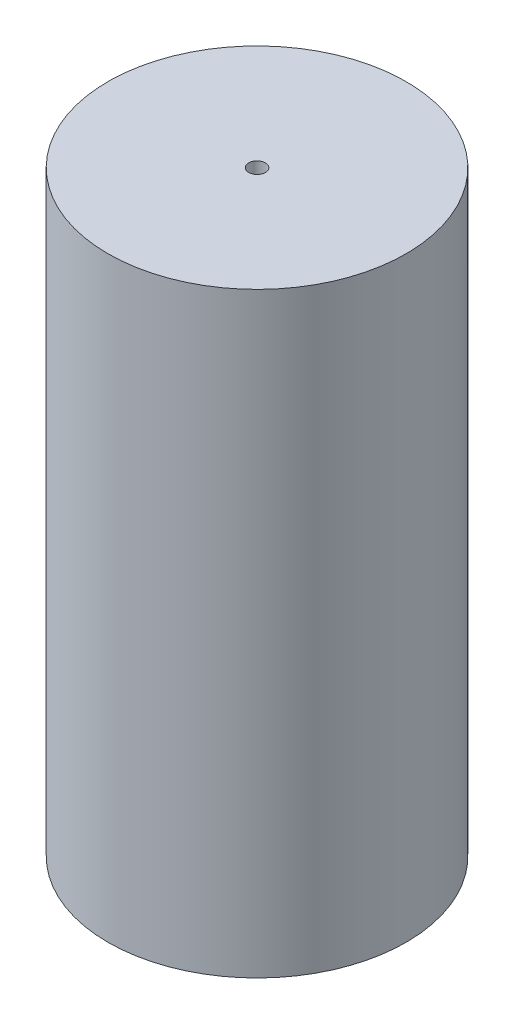
ISO-10303-21;
HEADER;
FILE_DESCRIPTION(('STEP AP214'),'2;1');
FILE_NAME('part.step','',(''),(''),'','','');
FILE_SCHEMA(('AUTOMOTIVE_DESIGN { 1 0 10303 214 1 1 1 1 }'));
ENDSEC;
DATA;
#1=APPLICATION_CONTEXT('core data for automotive mechanical design processes');
#2=APPLICATION_PROTOCOL_DEFINITION('international standard','automotive_design',2000,#1);
#3=PRODUCT_CONTEXT('',#1,'mechanical');
#4=PRODUCT('Part','Part','',(#3));
#5=PRODUCT_RELATED_PRODUCT_CATEGORY('part','',(#4));
#6=PRODUCT_DEFINITION_FORMATION('','',#4);
#7=PRODUCT_DEFINITION_CONTEXT('part definition',#1,'design');
#8=PRODUCT_DEFINITION('design','',#6,#7);
#9=PRODUCT_DEFINITION_SHAPE('','',#8);
#10=(LENGTH_UNIT() NAMED_UNIT(*) SI_UNIT(.MILLI.,.METRE.));
#11=(NAMED_UNIT(*) PLANE_ANGLE_UNIT() SI_UNIT($,.RADIAN.));
#12=(NAMED_UNIT(*) SI_UNIT($,.STERADIAN.) SOLID_ANGLE_UNIT());
#13=UNCERTAINTY_MEASURE_WITH_UNIT(LENGTH_MEASURE(1.E-05),#10,'distance_accuracy_value','');
#14=(GEOMETRIC_REPRESENTATION_CONTEXT(3) GLOBAL_UNCERTAINTY_ASSIGNED_CONTEXT((#13)) GLOBAL_UNIT_ASSIGNED_CONTEXT((#10,
#11,#12)) REPRESENTATION_CONTEXT('',''));
#15=CARTESIAN_POINT('',(0.,0.,0.));
#16=DIRECTION('',(0.,0.,1.));
#17=DIRECTION('',(1.,0.,0.));
#18=AXIS2_PLACEMENT_3D('',#15,#16,#17);
#19=CARTESIAN_POINT('',(0.,100.,0.));
#20=DIRECTION('',(0.,-1.,0.));
#21=DIRECTION('',(0.,0.,-1.));
#22=AXIS2_PLACEMENT_3D('',#19,#20,#21);
#23=CYLINDRICAL_SURFACE('',#22,25.);
#24=CARTESIAN_POINT('',(0.,100.,0.));
#25=DIRECTION('',(0.,1.,0.));
#26=DIRECTION('',(0.,0.,1.));
#27=AXIS2_PLACEMENT_3D('',#24,#25,#26);
#28=CIRCLE('',#27,25.);
#29=CARTESIAN_POINT('',(0.,100.,25.));
#30=VERTEX_POINT('',#29);
#31=EDGE_CURVE('E10',#30,#30,#28,.T.);
#32=ORIENTED_EDGE('',*,*,#31,.F.);
#33=EDGE_LOOP('',(#32));
#34=FACE_BOUND('',#33,.T.);
#35=CARTESIAN_POINT('',(0.,0.,0.));
#36=DIRECTION('',(0.,1.,0.));
#37=DIRECTION('',(0.,0.,1.));
#38=AXIS2_PLACEMENT_3D('',#35,#36,#37);
#39=CIRCLE('',#38,25.);
#40=CARTESIAN_POINT('',(0.,0.,25.));
#41=VERTEX_POINT('',#40);
#42=EDGE_CURVE('E39',#41,#41,#39,.T.);
#43=ORIENTED_EDGE('',*,*,#42,.T.);
#44=EDGE_LOOP('',(#43));
#45=FACE_BOUND('',#44,.T.);
#46=ADVANCED_FACE('F36',(#34,#45),#23,.T.);
#47=CARTESIAN_POINT('',(0.,100.,0.));
#48=DIRECTION('',(0.,1.,0.));
#49=DIRECTION('',(0.,0.,1.));
#50=AXIS2_PLACEMENT_3D('',#47,#48,#49);
#51=PLANE('',#50);
#52=CARTESIAN_POINT('',(0.,100.,0.));
#53=DIRECTION('',(0.,1.,0.));
#54=DIRECTION('',(0.,0.,1.));
#55=AXIS2_PLACEMENT_3D('',#52,#53,#54);
#56=CIRCLE('',#55,1.4);
#57=CARTESIAN_POINT('',(0.,100.,1.4));
#58=VERTEX_POINT('',#57);
#59=EDGE_CURVE('E50',#58,#58,#56,.T.);
#60=ORIENTED_EDGE('',*,*,#59,.F.);
#61=EDGE_LOOP('',(#60));
#62=FACE_BOUND('',#61,.T.);
#63=ORIENTED_EDGE('',*,*,#31,.T.);
#64=EDGE_LOOP('',(#63));
#65=FACE_BOUND('',#64,.T.);
#66=ADVANCED_FACE('F79',(#62,#65),#51,.T.);
#67=CARTESIAN_POINT('',(0.,0.,0.));
#68=DIRECTION('',(0.,1.,0.));
#69=DIRECTION('',(0.,0.,1.));
#70=AXIS2_PLACEMENT_3D('',#67,#68,#69);
#71=PLANE('',#70);
#72=CARTESIAN_POINT('',(0.,0.,0.));
#73=DIRECTION('',(0.,-1.,0.));
#74=DIRECTION('',(0.,0.,-1.));
#75=AXIS2_PLACEMENT_3D('',#72,#73,#74);
#76=CIRCLE('',#75,1.4);
#77=CARTESIAN_POINT('',(0.,0.,-1.4));
#78=VERTEX_POINT('',#77);
#79=EDGE_CURVE('E58',#78,#78,#76,.T.);
#80=ORIENTED_EDGE('',*,*,#79,.F.);
#81=EDGE_LOOP('',(#80));
#82=FACE_BOUND('',#81,.T.);
#83=ORIENTED_EDGE('',*,*,#42,.F.);
#84=EDGE_LOOP('',(#83));
#85=FACE_BOUND('',#84,.T.);
#86=ADVANCED_FACE('F75',(#82,#85),#71,.F.);
#87=CARTESIAN_POINT('',(0.,80.,0.));
#88=DIRECTION('',(0.,1.,0.));
#89=DIRECTION('',(0.,0.,1.));
#90=AXIS2_PLACEMENT_3D('',#87,#88,#89);
#91=CYLINDRICAL_SURFACE('',#90,1.4);
#92=CARTESIAN_POINT('',(0.,80.,0.));
#93=DIRECTION('',(0.,1.,0.));
#94=DIRECTION('',(0.,0.,1.));
#95=AXIS2_PLACEMENT_3D('',#92,#93,#94);
#96=CIRCLE('',#95,1.4);
#97=CARTESIAN_POINT('',(0.,80.,1.4));
#98=VERTEX_POINT('',#97);
#99=EDGE_CURVE('E48',#98,#98,#96,.T.);
#100=ORIENTED_EDGE('',*,*,#99,.F.);
#101=EDGE_LOOP('',(#100));
#102=FACE_BOUND('',#101,.T.);
#103=ORIENTED_EDGE('',*,*,#59,.T.);
#104=EDGE_LOOP('',(#103));
#105=FACE_BOUND('',#104,.T.);
#106=ADVANCED_FACE('F78',(#102,#105),#91,.F.);
#107=CARTESIAN_POINT('',(0.,80.,0.));
#108=DIRECTION('',(0.,1.,0.));
#109=DIRECTION('',(0.,0.,1.));
#110=AXIS2_PLACEMENT_3D('',#107,#108,#109);
#111=PLANE('',#110);
#112=ORIENTED_EDGE('',*,*,#99,.T.);
#113=EDGE_LOOP('',(#112));
#114=FACE_BOUND('',#113,.T.);
#115=ADVANCED_FACE('F71',(#114),#111,.T.);
#116=CARTESIAN_POINT('',(0.,20.,0.));
#117=DIRECTION('',(0.,-1.,0.));
#118=DIRECTION('',(0.,0.,-1.));
#119=AXIS2_PLACEMENT_3D('',#116,#117,#118);
#120=CYLINDRICAL_SURFACE('',#119,1.4);
#121=CARTESIAN_POINT('',(0.,20.,0.));
#122=DIRECTION('',(0.,-1.,0.));
#123=DIRECTION('',(0.,0.,-1.));
#124=AXIS2_PLACEMENT_3D('',#121,#122,#123);
#125=CIRCLE('',#124,1.4);
#126=CARTESIAN_POINT('',(0.,20.,-1.4));
#127=VERTEX_POINT('',#126);
#128=EDGE_CURVE('E54',#127,#127,#125,.T.);
#129=ORIENTED_EDGE('',*,*,#128,.F.);
#130=EDGE_LOOP('',(#129));
#131=FACE_BOUND('',#130,.T.);
#132=ORIENTED_EDGE('',*,*,#79,.T.);
#133=EDGE_LOOP('',(#132));
#134=FACE_BOUND('',#133,.T.);
#135=ADVANCED_FACE('F68',(#131,#134),#120,.F.);
#136=CARTESIAN_POINT('',(0.,20.,0.));
#137=DIRECTION('',(0.,-1.,0.));
#138=DIRECTION('',(0.,0.,-1.));
#139=AXIS2_PLACEMENT_3D('',#136,#137,#138);
#140=PLANE('',#139);
#141=ORIENTED_EDGE('',*,*,#128,.T.);
#142=EDGE_LOOP('',(#141));
#143=FACE_BOUND('',#142,.T.);
#144=ADVANCED_FACE('F66',(#143),#140,.T.);
#145=CLOSED_SHELL('',(#46,#66,#86,#106,#115,#135,#144));
#146=MANIFOLD_SOLID_BREP('B2',#145);
#147=ADVANCED_BREP_SHAPE_REPRESENTATION('',(#18,#146),#14);
#148=SHAPE_DEFINITION_REPRESENTATION(#9,#147);
ENDSEC;
END-ISO-10303-21;
